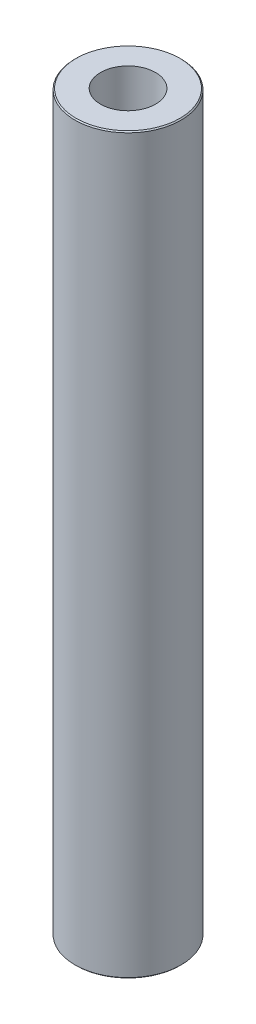
ISO-10303-21;
HEADER;
FILE_DESCRIPTION(('STEP AP214'),'2;1');
FILE_NAME('part.step','',(''),(''),'','','');
FILE_SCHEMA(('AUTOMOTIVE_DESIGN { 1 0 10303 214 1 1 1 1 }'));
ENDSEC;
DATA;
#1=APPLICATION_CONTEXT('core data for automotive mechanical design processes');
#2=APPLICATION_PROTOCOL_DEFINITION('international standard','automotive_design',2000,#1);
#3=PRODUCT_CONTEXT('',#1,'mechanical');
#4=PRODUCT('Part','Part','',(#3));
#5=PRODUCT_RELATED_PRODUCT_CATEGORY('part','',(#4));
#6=PRODUCT_DEFINITION_FORMATION('','',#4);
#7=PRODUCT_DEFINITION_CONTEXT('part definition',#1,'design');
#8=PRODUCT_DEFINITION('design','',#6,#7);
#9=PRODUCT_DEFINITION_SHAPE('','',#8);
#10=(LENGTH_UNIT() NAMED_UNIT(*) SI_UNIT(.MILLI.,.METRE.));
#11=(NAMED_UNIT(*) PLANE_ANGLE_UNIT() SI_UNIT($,.RADIAN.));
#12=(NAMED_UNIT(*) SI_UNIT($,.STERADIAN.) SOLID_ANGLE_UNIT());
#13=UNCERTAINTY_MEASURE_WITH_UNIT(LENGTH_MEASURE(1.E-05),#10,'distance_accuracy_value','');
#14=(GEOMETRIC_REPRESENTATION_CONTEXT(3) GLOBAL_UNCERTAINTY_ASSIGNED_CONTEXT((#13)) GLOBAL_UNIT_ASSIGNED_CONTEXT((#10,
#11,#12)) REPRESENTATION_CONTEXT('',''));
#15=CARTESIAN_POINT('',(0.,0.,0.));
#16=DIRECTION('',(0.,0.,1.));
#17=DIRECTION('',(1.,0.,0.));
#18=AXIS2_PLACEMENT_3D('',#15,#16,#17);
#19=CARTESIAN_POINT('',(0.,242.129487454503,0.));
#20=DIRECTION('',(0.,-1.,0.));
#21=DIRECTION('',(0.,0.,-1.));
#22=AXIS2_PLACEMENT_3D('',#19,#20,#21);
#23=CYLINDRICAL_SURFACE('',#22,17.5);
#24=CARTESIAN_POINT('',(0.,241.77334120003,0.));
#25=DIRECTION('',(0.,1.,0.));
#26=DIRECTION('',(0.,0.,1.));
#27=AXIS2_PLACEMENT_3D('',#24,#25,#26);
#28=CIRCLE('',#27,17.5);
#29=CARTESIAN_POINT('',(0.,241.77334120003,-17.5));
#30=VERTEX_POINT('',#29);
#31=EDGE_CURVE('E50',#30,#30,#28,.F.);
#32=CARTESIAN_POINT('',(0.,0.358221700798828,0.));
#33=DIRECTION('',(0.,1.,0.));
#34=DIRECTION('',(0.,0.,1.));
#35=AXIS2_PLACEMENT_3D('',#32,#33,#34);
#36=CIRCLE('',#35,17.5);
#37=CARTESIAN_POINT('',(0.,0.358221700798828,-17.5));
#38=VERTEX_POINT('',#37);
#39=EDGE_CURVE('E51',#38,#38,#36,.T.);
#40=CARTESIAN_POINT('',(0.,241.77334120003,-17.5));
#41=CARTESIAN_POINT('',(0.,239.258600371913,-17.5));
#42=CARTESIAN_POINT('',(0.,236.743859543796,-17.5));
#43=CARTESIAN_POINT('',(0.,231.714377887562,-17.5));
#44=CARTESIAN_POINT('',(0.,229.199637059445,-17.5));
#45=CARTESIAN_POINT('',(0.,224.170155403211,-17.5));
#46=CARTESIAN_POINT('',(0.,221.655414575094,-17.5));
#47=CARTESIAN_POINT('',(0.,216.62593291886,-17.5));
#48=CARTESIAN_POINT('',(0.,214.111192090743,-17.5));
#49=CARTESIAN_POINT('',(0.,209.081710434509,-17.5));
#50=CARTESIAN_POINT('',(0.,206.566969606392,-17.5));
#51=CARTESIAN_POINT('',(0.,201.537487950158,-17.5));
#52=CARTESIAN_POINT('',(0.,199.022747122041,-17.5));
#53=CARTESIAN_POINT('',(0.,193.993265465807,-17.5));
#54=CARTESIAN_POINT('',(0.,191.47852463769,-17.5));
#55=CARTESIAN_POINT('',(0.,186.449042981456,-17.5));
#56=CARTESIAN_POINT('',(0.,183.934302153339,-17.5));
#57=CARTESIAN_POINT('',(0.,178.904820497105,-17.5));
#58=CARTESIAN_POINT('',(0.,176.390079668988,-17.5));
#59=CARTESIAN_POINT('',(0.,171.360598012755,-17.5));
#60=CARTESIAN_POINT('',(0.,168.845857184637,-17.5));
#61=CARTESIAN_POINT('',(0.,163.816375528404,-17.5));
#62=CARTESIAN_POINT('',(0.,161.301634700287,-17.5));
#63=CARTESIAN_POINT('',(0.,156.272153044053,-17.5));
#64=CARTESIAN_POINT('',(0.,153.757412215936,-17.5));
#65=CARTESIAN_POINT('',(0.,148.727930559702,-17.5));
#66=CARTESIAN_POINT('',(0.,146.213189731585,-17.5));
#67=CARTESIAN_POINT('',(0.,141.183708075351,-17.5));
#68=CARTESIAN_POINT('',(0.,138.668967247234,-17.5));
#69=CARTESIAN_POINT('',(0.,133.639485591,-17.5));
#70=CARTESIAN_POINT('',(0.,131.124744762883,-17.5));
#71=CARTESIAN_POINT('',(0.,126.095263106649,-17.5));
#72=CARTESIAN_POINT('',(0.,123.580522278532,-17.5));
#73=CARTESIAN_POINT('',(0.,118.551040622298,-17.5));
#74=CARTESIAN_POINT('',(0.,116.036299794181,-17.5));
#75=CARTESIAN_POINT('',(0.,111.006818137947,-17.5));
#76=CARTESIAN_POINT('',(0.,108.49207730983,-17.5));
#77=CARTESIAN_POINT('',(0.,103.462595653596,-17.5));
#78=CARTESIAN_POINT('',(0.,100.947854825479,-17.5));
#79=CARTESIAN_POINT('',(0.,95.9183731692446,-17.5));
#80=CARTESIAN_POINT('',(0.,93.4036323411277,-17.5));
#81=CARTESIAN_POINT('',(0.,88.3741506848937,-17.5));
#82=CARTESIAN_POINT('',(0.,85.8594098567767,-17.5));
#83=CARTESIAN_POINT('',(0.,80.8299282005427,-17.5));
#84=CARTESIAN_POINT('',(0.,78.3151873724257,-17.5));
#85=CARTESIAN_POINT('',(0.,73.2857057161917,-17.5));
#86=CARTESIAN_POINT('',(0.,70.7709648880747,-17.5));
#87=CARTESIAN_POINT('',(0.,65.7414832318407,-17.5));
#88=CARTESIAN_POINT('',(0.,63.2267424037237,-17.5));
#89=CARTESIAN_POINT('',(0.,58.1972607474897,-17.5));
#90=CARTESIAN_POINT('',(0.,55.6825199193727,-17.5));
#91=CARTESIAN_POINT('',(0.,50.6530382631387,-17.5));
#92=CARTESIAN_POINT('',(0.,48.1382974350217,-17.5));
#93=CARTESIAN_POINT('',(0.,43.1088157787877,-17.5));
#94=CARTESIAN_POINT('',(0.,40.5940749506708,-17.5));
#95=CARTESIAN_POINT('',(0.,35.5645932944368,-17.5));
#96=CARTESIAN_POINT('',(0.,33.0498524663198,-17.5));
#97=CARTESIAN_POINT('',(0.,28.0203708100858,-17.5));
#98=CARTESIAN_POINT('',(0.,25.5056299819688,-17.5));
#99=CARTESIAN_POINT('',(0.,20.4761483257348,-17.5));
#100=CARTESIAN_POINT('',(0.,17.9614074976178,-17.5));
#101=CARTESIAN_POINT('',(0.,12.9319258413838,-17.5));
#102=CARTESIAN_POINT('',(0.,10.4171850132668,-17.5));
#103=CARTESIAN_POINT('',(0.,5.38770335703282,-17.5));
#104=CARTESIAN_POINT('',(0.,2.87296252891582,-17.5));
#105=CARTESIAN_POINT('',(0.,0.358221700798828,-17.5));
#106=B_SPLINE_CURVE_WITH_KNOTS('',3,(#40,#41,#42,#43,#44,#45,#46,#47,#48,#49,#50,#51,#52,#53,
#54,#55,#56,#57,#58,#59,#60,#61,#62,#63,#64,#65,#66,#67,#68,#69,#70,#71,#72,#73,#74,#75,#76,#77,
#78,#79,#80,#81,#82,#83,#84,#85,#86,#87,#88,#89,#90,#91,#92,#93,#94,#95,#96,#97,#98,#99,#100,
#101,#102,#103,#104,#105),.UNSPECIFIED.,.F.,.F.,(4,2,2,2,2,2,2,2,2,2,2,2,2,2,2,2,2,2,2,2,2,2,2,
2,2,2,2,2,2,2,2,2,4),(0.,7.54422248435097,15.088444968702,22.632667453053,30.1768899374039,
37.7211124217549,45.2653349061059,52.8095573904569,60.3537798748079,67.8980023591589,
75.4422248435098,82.9864473278608,90.5306698122118,98.0748922965628,105.619114780914,
113.163337265265,120.707559749616,128.251782233967,135.796004718318,143.340227202669,
150.88444968702,158.428672171371,165.972894655722,173.517117140073,181.061339624424,
188.605562108775,196.149784593126,203.694007077477,211.238229561828,218.782452046179,
226.32667453053,233.870897014881,241.415119499232),.UNSPECIFIED.);
#107=EDGE_CURVE('BSEAM39',#30,#38,#106,.T.);
#108=ORIENTED_EDGE('',*,*,#31,.T.);
#109=ORIENTED_EDGE('',*,*,#39,.T.);
#110=ORIENTED_EDGE('',*,*,#107,.T.);
#111=ORIENTED_EDGE('',*,*,#107,.F.);
#112=EDGE_LOOP('',(#108,#110,#109,#111));
#113=FACE_BOUND('',#112,.T.);
#114=ADVANCED_FACE('F39',(#113),#23,.T.);
#115=CARTESIAN_POINT('',(0.,242.129487454503,0.));
#116=DIRECTION('',(0.,1.,0.));
#117=DIRECTION('',(0.,0.,1.));
#118=AXIS2_PLACEMENT_3D('',#115,#116,#117);
#119=PLANE('',#118);
#120=CARTESIAN_POINT('',(0.,242.129487454503,0.));
#121=DIRECTION('',(0.,1.,0.));
#122=DIRECTION('',(0.,0.,1.));
#123=AXIS2_PLACEMENT_3D('',#120,#121,#122);
#124=CIRCLE('',#123,17.1417782992014);
#125=CARTESIAN_POINT('',(0.,242.129487454503,17.1417782992014));
#126=VERTEX_POINT('',#125);
#127=EDGE_CURVE('E54',#126,#126,#124,.T.);
#128=ORIENTED_EDGE('',*,*,#127,.T.);
#129=EDGE_LOOP('',(#128));
#130=FACE_BOUND('',#129,.T.);
#131=CARTESIAN_POINT('',(0.,242.129487454503,0.));
#132=DIRECTION('',(0.,1.,0.));
#133=DIRECTION('',(0.,0.,1.));
#134=AXIS2_PLACEMENT_3D('',#131,#132,#133);
#135=CIRCLE('',#134,9.07558342505214);
#136=CARTESIAN_POINT('',(0.,242.129487454503,-9.07558342505214));
#137=VERTEX_POINT('',#136);
#138=EDGE_CURVE('E58',#137,#137,#135,.T.);
#139=ORIENTED_EDGE('',*,*,#138,.F.);
#140=EDGE_LOOP('',(#139));
#141=FACE_BOUND('',#140,.T.);
#142=ADVANCED_FACE('F69',(#130,#141),#119,.T.);
#143=CARTESIAN_POINT('',(0.,0.,0.));
#144=DIRECTION('',(0.,1.,0.));
#145=DIRECTION('',(0.,0.,1.));
#146=AXIS2_PLACEMENT_3D('',#143,#144,#145);
#147=PLANE('',#146);
#148=CARTESIAN_POINT('',(0.,0.,0.));
#149=DIRECTION('',(0.,1.,0.));
#150=DIRECTION('',(0.,0.,1.));
#151=AXIS2_PLACEMENT_3D('',#148,#149,#150);
#152=CIRCLE('',#151,17.1438537455274);
#153=CARTESIAN_POINT('',(0.,0.,17.1438537455274));
#154=VERTEX_POINT('',#153);
#155=EDGE_CURVE('E10',#154,#154,#152,.F.);
#156=ORIENTED_EDGE('',*,*,#155,.T.);
#157=EDGE_LOOP('',(#156));
#158=FACE_BOUND('',#157,.T.);
#159=CARTESIAN_POINT('',(0.,0.,0.));
#160=DIRECTION('',(0.,1.,0.));
#161=DIRECTION('',(0.,0.,1.));
#162=AXIS2_PLACEMENT_3D('',#159,#160,#161);
#163=CIRCLE('',#162,9.07558342505214);
#164=CARTESIAN_POINT('',(0.,0.,-9.07558342505214));
#165=VERTEX_POINT('',#164);
#166=EDGE_CURVE('E63',#165,#165,#163,.T.);
#167=ORIENTED_EDGE('',*,*,#166,.T.);
#168=EDGE_LOOP('',(#167));
#169=FACE_BOUND('',#168,.T.);
#170=ADVANCED_FACE('F75',(#158,#169),#147,.F.);
#171=CARTESIAN_POINT('',(0.,242.129487454503,0.));
#172=DIRECTION('',(0.,-1.,0.));
#173=DIRECTION('',(0.,0.,-1.));
#174=AXIS2_PLACEMENT_3D('',#171,#172,#173);
#175=CYLINDRICAL_SURFACE('',#174,9.07558342505214);
#176=CARTESIAN_POINT('',(0.,242.129487454503,-9.07558342505214));
#177=CARTESIAN_POINT('',(0.,239.607305293518,-9.07558342505214));
#178=CARTESIAN_POINT('',(0.,237.085123132534,-9.07558342505214));
#179=CARTESIAN_POINT('',(0.,232.040758810565,-9.07558342505214));
#180=CARTESIAN_POINT('',(0.,229.518576649581,-9.07558342505214));
#181=CARTESIAN_POINT('',(0.,224.474212327612,-9.07558342505214));
#182=CARTESIAN_POINT('',(0.,221.952030166628,-9.07558342505214));
#183=CARTESIAN_POINT('',(0.,216.907665844659,-9.07558342505214));
#184=CARTESIAN_POINT('',(0.,214.385483683674,-9.07558342505214));
#185=CARTESIAN_POINT('',(0.,209.341119361705,-9.07558342505214));
#186=CARTESIAN_POINT('',(0.,206.818937200721,-9.07558342505214));
#187=CARTESIAN_POINT('',(0.,201.774572878752,-9.07558342505214));
#188=CARTESIAN_POINT('',(0.,199.252390717768,-9.07558342505214));
#189=CARTESIAN_POINT('',(0.,194.208026395799,-9.07558342505214));
#190=CARTESIAN_POINT('',(0.,191.685844234815,-9.07558342505214));
#191=CARTESIAN_POINT('',(0.,186.641479912846,-9.07558342505214));
#192=CARTESIAN_POINT('',(0.,184.119297751861,-9.07558342505214));
#193=CARTESIAN_POINT('',(0.,179.074933429893,-9.07558342505214));
#194=CARTESIAN_POINT('',(0.,176.552751268908,-9.07558342505214));
#195=CARTESIAN_POINT('',(0.,171.508386946939,-9.07558342505214));
#196=CARTESIAN_POINT('',(0.,168.986204785955,-9.07558342505214));
#197=CARTESIAN_POINT('',(0.,163.941840463986,-9.07558342505214));
#198=CARTESIAN_POINT('',(0.,161.419658303002,-9.07558342505214));
#199=CARTESIAN_POINT('',(0.,156.375293981033,-9.07558342505214));
#200=CARTESIAN_POINT('',(0.,153.853111820049,-9.07558342505214));
#201=CARTESIAN_POINT('',(0.,148.80874749808,-9.07558342505214));
#202=CARTESIAN_POINT('',(0.,146.286565337095,-9.07558342505214));
#203=CARTESIAN_POINT('',(0.,141.242201015127,-9.07558342505214));
#204=CARTESIAN_POINT('',(0.,138.720018854142,-9.07558342505214));
#205=CARTESIAN_POINT('',(0.,133.675654532173,-9.07558342505214));
#206=CARTESIAN_POINT('',(0.,131.153472371189,-9.07558342505214));
#207=CARTESIAN_POINT('',(0.,126.10910804922,-9.07558342505214));
#208=CARTESIAN_POINT('',(0.,123.586925888236,-9.07558342505214));
#209=CARTESIAN_POINT('',(0.,118.542561566267,-9.07558342505214));
#210=CARTESIAN_POINT('',(0.,116.020379405283,-9.07558342505214));
#211=CARTESIAN_POINT('',(0.,110.976015083314,-9.07558342505214));
#212=CARTESIAN_POINT('',(0.,108.453832922329,-9.07558342505214));
#213=CARTESIAN_POINT('',(0.,103.409468600361,-9.07558342505214));
#214=CARTESIAN_POINT('',(0.,100.887286439376,-9.07558342505214));
#215=CARTESIAN_POINT('',(0.,95.8429221174073,-9.07558342505214));
#216=CARTESIAN_POINT('',(0.,93.3207399564229,-9.07558342505214));
#217=CARTESIAN_POINT('',(0.,88.2763756344541,-9.07558342505214));
#218=CARTESIAN_POINT('',(0.,85.7541934734697,-9.07558342505214));
#219=CARTESIAN_POINT('',(0.,80.7098291515009,-9.07558342505214));
#220=CARTESIAN_POINT('',(0.,78.1876469905165,-9.07558342505214));
#221=CARTESIAN_POINT('',(0.,73.1432826685477,-9.07558342505214));
#222=CARTESIAN_POINT('',(0.,70.6211005075633,-9.07558342505214));
#223=CARTESIAN_POINT('',(0.,65.5767361855945,-9.07558342505214));
#224=CARTESIAN_POINT('',(0.,63.0545540246101,-9.07558342505214));
#225=CARTESIAN_POINT('',(0.,58.0101897026413,-9.07558342505214));
#226=CARTESIAN_POINT('',(0.,55.4880075416569,-9.07558342505214));
#227=CARTESIAN_POINT('',(0.,50.4436432196881,-9.07558342505214));
#228=CARTESIAN_POINT('',(0.,47.9214610587036,-9.07558342505214));
#229=CARTESIAN_POINT('',(0.,42.8770967367348,-9.07558342505214));
#230=CARTESIAN_POINT('',(0.,40.3549145757504,-9.07558342505214));
#231=CARTESIAN_POINT('',(0.,35.3105502537816,-9.07558342505214));
#232=CARTESIAN_POINT('',(0.,32.7883680927972,-9.07558342505214));
#233=CARTESIAN_POINT('',(0.,27.7440037708284,-9.07558342505214));
#234=CARTESIAN_POINT('',(0.,25.221821609844,-9.07558342505214));
#235=CARTESIAN_POINT('',(0.,20.1774572878752,-9.07558342505214));
#236=CARTESIAN_POINT('',(0.,17.6552751268908,-9.07558342505214));
#237=CARTESIAN_POINT('',(0.,12.610910804922,-9.07558342505214));
#238=CARTESIAN_POINT('',(0.,10.0887286439376,-9.07558342505214));
#239=CARTESIAN_POINT('',(0.,5.04436432196878,-9.07558342505214));
#240=CARTESIAN_POINT('',(0.,2.52218216098438,-9.07558342505214));
#241=CARTESIAN_POINT('',(0.,0.,-9.07558342505214));
#242=B_SPLINE_CURVE_WITH_KNOTS('',3,(#176,#177,#178,#179,#180,#181,#182,#183,#184,#185,#186,
#187,#188,#189,#190,#191,#192,#193,#194,#195,#196,#197,#198,#199,#200,#201,#202,#203,#204,#205,
#206,#207,#208,#209,#210,#211,#212,#213,#214,#215,#216,#217,#218,#219,#220,#221,#222,#223,#224,
#225,#226,#227,#228,#229,#230,#231,#232,#233,#234,#235,#236,#237,#238,#239,#240,#241),
.UNSPECIFIED.,.F.,.F.,(4,2,2,2,2,2,2,2,2,2,2,2,2,2,2,2,2,2,2,2,2,2,2,2,2,2,2,2,2,2,2,2,4),(0.,
7.56654648295318,15.1330929659064,22.6996394488596,30.2661859318128,37.832732414766,
45.3992788977192,52.9658253806725,60.5323718636257,68.0989183465789,75.6654648295321,
83.2320113124853,90.7985577954385,98.3651042783917,105.931650761345,113.498197244298,
121.064743727251,128.631290210205,136.197836693158,143.764383176111,151.330929659064,
158.897476142017,166.464022624971,174.030569107924,181.597115590877,189.16366207383,
196.730208556783,204.296755039737,211.86330152269,219.429848005643,226.996394488596,
234.56294097155,242.129487454503),.UNSPECIFIED.);
#243=EDGE_CURVE('BSEAM70',#137,#165,#242,.T.);
#244=ORIENTED_EDGE('',*,*,#138,.T.);
#245=ORIENTED_EDGE('',*,*,#166,.F.);
#246=ORIENTED_EDGE('',*,*,#243,.T.);
#247=ORIENTED_EDGE('',*,*,#243,.F.);
#248=EDGE_LOOP('',(#244,#246,#245,#247));
#249=FACE_BOUND('',#248,.T.);
#250=ADVANCED_FACE('F70',(#249),#175,.F.);
#251=CARTESIAN_POINT('',(0.,242.129487454503,0.));
#252=DIRECTION('',(0.,-1.,0.));
#253=DIRECTION('',(0.,0.,-1.));
#254=AXIS2_PLACEMENT_3D('',#251,#252,#253);
#255=CONICAL_SURFACE('',#254,17.1417782992014,0.788303445572465);
#256=ORIENTED_EDGE('',*,*,#31,.F.);
#257=EDGE_LOOP('',(#256));
#258=FACE_BOUND('',#257,.T.);
#259=ORIENTED_EDGE('',*,*,#127,.F.);
#260=EDGE_LOOP('',(#259));
#261=FACE_BOUND('',#260,.T.);
#262=ADVANCED_FACE('F81',(#258,#261),#255,.T.);
#263=CARTESIAN_POINT('',(0.,0.358221700798828,0.));
#264=DIRECTION('',(0.,1.,0.));
#265=DIRECTION('',(0.,0.,1.));
#266=AXIS2_PLACEMENT_3D('',#263,#264,#265);
#267=CONICAL_SURFACE('',#266,17.5,0.782492881222492);
#268=ORIENTED_EDGE('',*,*,#155,.F.);
#269=EDGE_LOOP('',(#268));
#270=FACE_BOUND('',#269,.T.);
#271=ORIENTED_EDGE('',*,*,#39,.F.);
#272=EDGE_LOOP('',(#271));
#273=FACE_BOUND('',#272,.T.);
#274=ADVANCED_FACE('F45',(#270,#273),#267,.T.);
#275=CLOSED_SHELL('',(#114,#142,#170,#250,#262,#274));
#276=MANIFOLD_SOLID_BREP('B2',#275);
#277=ADVANCED_BREP_SHAPE_REPRESENTATION('',(#18,#276),#14);
#278=SHAPE_DEFINITION_REPRESENTATION(#9,#277);
ENDSEC;
END-ISO-10303-21;
